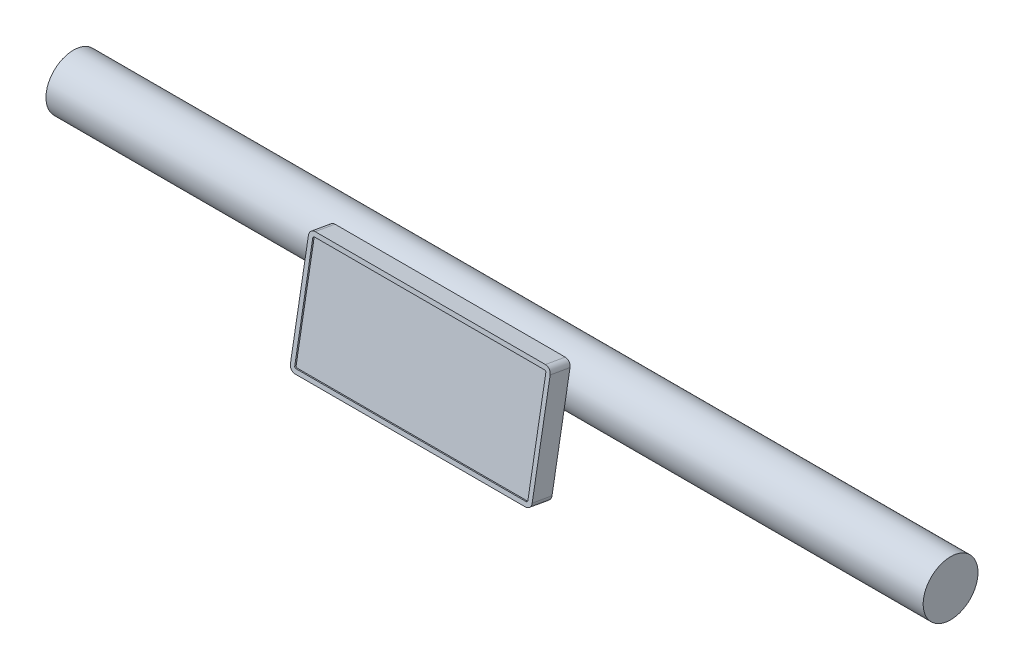
ISO-10303-21;
HEADER;
FILE_DESCRIPTION(('STEP AP214'),'2;1');
FILE_NAME('part.step','',(''),(''),'','','');
FILE_SCHEMA(('AUTOMOTIVE_DESIGN { 1 0 10303 214 1 1 1 1 }'));
ENDSEC;
DATA;
#1=APPLICATION_CONTEXT('core data for automotive mechanical design processes');
#2=APPLICATION_PROTOCOL_DEFINITION('international standard','automotive_design',2000,#1);
#3=PRODUCT_CONTEXT('',#1,'mechanical');
#4=PRODUCT('Part','Part','',(#3));
#5=PRODUCT_RELATED_PRODUCT_CATEGORY('part','',(#4));
#6=PRODUCT_DEFINITION_FORMATION('','',#4);
#7=PRODUCT_DEFINITION_CONTEXT('part definition',#1,'design');
#8=PRODUCT_DEFINITION('design','',#6,#7);
#9=PRODUCT_DEFINITION_SHAPE('','',#8);
#10=(LENGTH_UNIT() NAMED_UNIT(*) SI_UNIT(.MILLI.,.METRE.));
#11=(NAMED_UNIT(*) PLANE_ANGLE_UNIT() SI_UNIT($,.RADIAN.));
#12=(NAMED_UNIT(*) SI_UNIT($,.STERADIAN.) SOLID_ANGLE_UNIT());
#13=UNCERTAINTY_MEASURE_WITH_UNIT(LENGTH_MEASURE(1.E-05),#10,'distance_accuracy_value','');
#14=(GEOMETRIC_REPRESENTATION_CONTEXT(3) GLOBAL_UNCERTAINTY_ASSIGNED_CONTEXT((#13)) GLOBAL_UNIT_ASSIGNED_CONTEXT((#10,
#11,#12)) REPRESENTATION_CONTEXT('',''));
#15=CARTESIAN_POINT('',(0.,0.,0.));
#16=DIRECTION('',(0.,0.,1.));
#17=DIRECTION('',(1.,0.,0.));
#18=AXIS2_PLACEMENT_3D('',#15,#16,#17);
#19=CARTESIAN_POINT('',(0.,8.802727013857,49.9227456767448));
#20=DIRECTION('',(0.,0.173648177666931,0.984807753012208));
#21=DIRECTION('',(0.,-0.984807753012208,0.173648177666931));
#22=AXIS2_PLACEMENT_3D('',#19,#20,#21);
#23=PLANE('',#22);
#24=CARTESIAN_POINT('',(0.,8.802727013857,49.9227456767448));
#25=DIRECTION('',(0.,0.173648177666931,0.984807753012208));
#26=DIRECTION('',(0.,-0.984807753012208,0.173648177666931));
#27=AXIS2_PLACEMENT_3D('',#24,#25,#26);
#28=CIRCLE('',#27,8.26951653831873);
#29=CARTESIAN_POINT('',(0.,0.658843013258035,51.3587321538104));
#30=VERTEX_POINT('',#29);
#31=EDGE_CURVE('E67',#30,#30,#28,.T.);
#32=ORIENTED_EDGE('',*,*,#31,.T.);
#33=EDGE_LOOP('',(#32));
#34=FACE_BOUND('',#33,.T.);
#35=ADVANCED_FACE('F55',(#34),#23,.T.);
#36=CARTESIAN_POINT('',(0.,-4.18033182314457,-23.7078398685691));
#37=DIRECTION('',(0.,0.173648177666931,0.984807753012208));
#38=DIRECTION('',(0.,-0.984807753012208,0.173648177666931));
#39=AXIS2_PLACEMENT_3D('',#36,#37,#38);
#40=CYLINDRICAL_SURFACE('',#39,8.26951653831873);
#41=ORIENTED_EDGE('',*,*,#31,.F.);
#42=EDGE_LOOP('',(#41));
#43=FACE_BOUND('',#42,.T.);
#44=CARTESIAN_POINT('',(0.,-5.16381819926072,18.3367794774596));
#45=CARTESIAN_POINT('',(0.219655189088394,-5.16381620151997,18.3367810072159));
#46=CARTESIAN_POINT('',(0.439377320265203,-5.15445218994636,18.3394250431891));
#47=CARTESIAN_POINT('',(0.877206124997379,-5.11711204636189,18.349878141058));
#48=CARTESIAN_POINT('',(1.0953117177098,-5.08912442970438,18.3576903900263));
#49=CARTESIAN_POINT('',(1.52861103917354,-5.01483376242632,18.3781235909721));
#50=CARTESIAN_POINT('',(1.74379794821304,-4.96849359966656,18.3907542847957));
#51=CARTESIAN_POINT('',(2.1693553898151,-4.85807181949629,18.4202306527568));
#52=CARTESIAN_POINT('',(2.37972384250744,-4.79398269143535,18.4370781109689));
#53=CARTESIAN_POINT('',(2.79320907436325,-4.64916156075512,18.4741265133544));
#54=CARTESIAN_POINT('',(2.99635569306548,-4.56851051984341,18.4943110542451));
#55=CARTESIAN_POINT('',(3.39530234032595,-4.39121124897656,18.5372077617755));
#56=CARTESIAN_POINT('',(3.59109952406292,-4.29455690121431,18.559920893963));
#57=CARTESIAN_POINT('',(4.16558220269779,-3.98204064357322,18.6303920741817));
#58=CARTESIAN_POINT('',(4.53185461897858,-3.74344964140626,18.6805303026413));
#59=CARTESIAN_POINT('',(5.24497906273722,-3.19660833463106,18.7820620957828));
#60=CARTESIAN_POINT('',(5.58925749145999,-2.88498020521202,18.8333436920081));
#61=CARTESIAN_POINT('',(6.06574549283916,-2.37915173975581,18.9016204565863));
#62=CARTESIAN_POINT('',(6.21801289866175,-2.20400781880632,18.9229503928001));
#63=CARTESIAN_POINT('',(6.50837045063005,-1.84195994240168,18.9616130191569));
#64=CARTESIAN_POINT('',(6.64646581892849,-1.6550603599488,18.9789471846283));
#65=CARTESIAN_POINT('',(6.91391112904946,-1.26134229356765,19.0092704992803));
#66=CARTESIAN_POINT('',(7.04251542177446,-1.05399765185977,19.0220090501553));
#67=CARTESIAN_POINT('',(7.2820858929146,-0.62916544243483,19.0407938158614));
#68=CARTESIAN_POINT('',(7.39305936723974,-0.41168211870728,19.0468428051478));
#69=CARTESIAN_POINT('',(7.59639024251035,0.031870927593084,19.0512640179856));
#70=CARTESIAN_POINT('',(7.68875034909277,0.257939396544343,19.049637358109));
#71=CARTESIAN_POINT('',(7.85390595137308,0.716900581027549,19.0378893011702));
#72=CARTESIAN_POINT('',(7.92670294901037,0.949792771151303,19.0277685564797));
#73=CARTESIAN_POINT('',(8.0483948285927,1.40727812909326,18.999253277779));
#74=CARTESIAN_POINT('',(8.09839838881553,1.63160743825881,18.9813528899846));
#75=CARTESIAN_POINT('',(8.1796646050306,2.08282320408284,18.9371518933546));
#76=CARTESIAN_POINT('',(8.21092790061269,2.30970957320166,18.9108515712488));
#77=CARTESIAN_POINT('',(8.25433593686597,2.76408749625969,18.8497970370862));
#78=CARTESIAN_POINT('',(8.26648785747635,2.99157879074444,18.8150460055386));
#79=CARTESIAN_POINT('',(8.27154654325693,3.4453521266954,18.73726311607));
#80=CARTESIAN_POINT('',(8.26445413183389,3.67163421948461,18.6942316125186));
#81=CARTESIAN_POINT('',(8.23222088466368,4.10622855803215,18.6034235315635));
#82=CARTESIAN_POINT('',(8.20830661590132,4.31473831077778,18.5561500346328));
#83=CARTESIAN_POINT('',(8.1440183854232,4.72772030680401,18.4552528319562));
#84=CARTESIAN_POINT('',(8.10363873425165,4.93219112883995,18.4016269357483));
#85=CARTESIAN_POINT('',(8.00683927674423,5.33561651185817,18.288727740533));
#86=CARTESIAN_POINT('',(7.95042493341361,5.53457292630013,18.229456369499));
#87=CARTESIAN_POINT('',(7.82205432252265,5.9259248827998,18.1060220225364));
#88=CARTESIAN_POINT('',(7.7500921336416,6.11831789280371,18.0418571889972));
#89=CARTESIAN_POINT('',(7.59007361454988,6.49822778853301,17.9085640049179));
#90=CARTESIAN_POINT('',(7.5017935720117,6.68562939356093,17.8393759681607));
#91=CARTESIAN_POINT('',(7.31055181769443,7.05163642653049,17.6978935920865));
#92=CARTESIAN_POINT('',(7.20758512917372,7.23023884505037,17.6255982056333));
#93=CARTESIAN_POINT('',(6.98771936349512,7.57779855925861,17.4789887915528));
#94=CARTESIAN_POINT('',(6.87081881378961,7.74675483273498,17.4046745512124));
#95=CARTESIAN_POINT('',(6.62383700033592,8.07432473566308,17.2551500486373));
#96=CARTESIAN_POINT('',(6.49375492345079,8.23293772606923,17.1799397313786));
#97=CARTESIAN_POINT('',(6.21081833849405,8.55083166435873,17.0240841807172));
#98=CARTESIAN_POINT('',(6.05698515220065,8.70925242505503,16.9434589807021));
#99=CARTESIAN_POINT('',(5.73589016715686,9.01271780201716,16.7840041801993));
#100=CARTESIAN_POINT('',(5.56863210989635,9.15776612111395,16.7051740872263));
#101=CARTESIAN_POINT('',(5.221424591404,9.43403560188141,16.5507262738723));
#102=CARTESIAN_POINT('',(5.04146508489779,9.56524560990465,16.4751111736246));
#103=CARTESIAN_POINT('',(4.66999823583057,9.81305277028846,16.3287232346911));
#104=CARTESIAN_POINT('',(4.47849533304577,9.92965548839816,16.2579485563772));
#105=CARTESIAN_POINT('',(4.07725220182073,10.1519344956019,16.120126880594));
#106=CARTESIAN_POINT('',(3.86709267344189,10.2570113728108,16.0533310309602));
#107=CARTESIAN_POINT('',(3.43671450534751,10.4500691433459,15.9283327234478));
#108=CARTESIAN_POINT('',(3.21650035026974,10.5380575683416,15.8701264824612));
#109=CARTESIAN_POINT('',(2.76748840573833,10.6962782861926,15.7639213269818));
#110=CARTESIAN_POINT('',(2.5386941306581,10.7665177596453,15.7159182858881));
#111=CARTESIAN_POINT('',(2.07416282288511,10.88863657127,15.6315583415802));
#112=CARTESIAN_POINT('',(1.83842647581516,10.9405177160298,15.5952002924509));
#113=CARTESIAN_POINT('',(1.37832858353715,11.0224692426172,15.5373745607957));
#114=CARTESIAN_POINT('',(1.1542965293065,11.0537919980023,15.5150562925459));
#115=CARTESIAN_POINT('',(0.703666982364702,11.0997326331803,15.4822233690735));
#116=CARTESIAN_POINT('',(0.477069609528967,11.1143512903158,15.4717081645834));
#117=CARTESIAN_POINT('',(0.0232557456098629,11.1267270546186,15.4628103229334));
#118=CARTESIAN_POINT('',(-0.203960505411435,11.1244899663159,15.4644235091789));
#119=CARTESIAN_POINT('',(-0.657188075181639,11.1031918666497,15.4797223078762));
#120=CARTESIAN_POINT('',(-0.883199436513483,11.0841314538712,15.4934074907984));
#121=CARTESIAN_POINT('',(-1.31590264005513,11.0313743004465,15.5310089177762));
#122=CARTESIAN_POINT('',(-1.52280839927234,10.9988372942582,15.5541125903008));
#123=CARTESIAN_POINT('',(-1.93269712359148,10.9197286673815,15.6097521603309));
#124=CARTESIAN_POINT('',(-2.1356787212761,10.8731522450711,15.642291284711));
#125=CARTESIAN_POINT('',(-2.5363665613543,10.7663327724747,15.7160040799502));
#126=CARTESIAN_POINT('',(-2.7340738138688,10.7060923603668,15.7571760838981));
#127=CARTESIAN_POINT('',(-3.12318186832205,10.5723525806163,15.8472188776646));
#128=CARTESIAN_POINT('',(-3.31458016211612,10.4988480131973,15.8960926857671));
#129=CARTESIAN_POINT('',(-3.89411531939922,10.2521195510539,16.0572828201591));
#130=CARTESIAN_POINT('',(-4.27020256925192,10.0572841574041,16.1808613514844));
#131=CARTESIAN_POINT('',(-4.98308242676739,9.61564131813472,16.4471328098606));
#132=CARTESIAN_POINT('',(-5.31985695230412,9.36881010196558,16.5898344683976));
#133=CARTESIAN_POINT('',(-5.80482438016334,8.95062396370954,16.8171678001365));
#134=CARTESIAN_POINT('',(-5.96915440289585,8.7959601822193,16.8987109333524));
#135=CARTESIAN_POINT('',(-6.28329051276508,8.47309401346254,17.0628815972656));
#136=CARTESIAN_POINT('',(-6.43310138276642,8.3048961182178,17.1455087606109));
#137=CARTESIAN_POINT('',(-6.71731571956639,7.95559631456639,17.3103526547372));
#138=CARTESIAN_POINT('',(-6.85171073401001,7.77448741458993,17.3925691369422));
#139=CARTESIAN_POINT('',(-7.10396622397094,7.40037337680125,17.5550144702211));
#140=CARTESIAN_POINT('',(-7.22183386095243,7.20737344398979,17.6352441697001));
#141=CARTESIAN_POINT('',(-7.44081636969456,6.80914237893688,17.7928137217949));
#142=CARTESIAN_POINT('',(-7.54181887713926,6.60384070199626,17.8701317247966));
#143=CARTESIAN_POINT('',(-7.72517783884507,6.18336537440777,18.0199415651736));
#144=CARTESIAN_POINT('',(-7.80753401384833,5.96819157596756,18.0924333302569));
#145=CARTESIAN_POINT('',(-7.95267402458318,5.52955265023494,18.2312762523699));
#146=CARTESIAN_POINT('',(-8.01546832208403,5.30609202657603,18.2976306782759));
#147=CARTESIAN_POINT('',(-8.12079859221801,4.85247199311595,18.4231206356784));
#148=CARTESIAN_POINT('',(-8.16333624918694,4.62231314196038,18.4822567670704));
#149=CARTESIAN_POINT('',(-8.22521731385455,4.17460173091883,18.5882787741812));
#150=CARTESIAN_POINT('',(-8.24605724606268,3.95739344282192,18.6357500179855));
#151=CARTESIAN_POINT('',(-8.2697086412662,3.5205050243494,18.7231985019581));
#152=CARTESIAN_POINT('',(-8.27252105188549,3.30082502450843,18.7631761359238));
#153=CARTESIAN_POINT('',(-8.26008723488128,2.86073550777799,18.8352968624309));
#154=CARTESIAN_POINT('',(-8.24484426759246,2.64032612976131,18.8674413681693));
#155=CARTESIAN_POINT('',(-8.19647890896205,2.20045953653846,18.9237850492549));
#156=CARTESIAN_POINT('',(-8.16335668642668,1.9810023123623,18.9479842996134));
#157=CARTESIAN_POINT('',(-8.0813269459123,1.55372257024157,18.9876954796592));
#158=CARTESIAN_POINT('',(-8.03312583930689,1.34579316014542,19.0035241902463));
#159=CARTESIAN_POINT('',(-7.92106815093662,0.93370281306111,19.0282243642802));
#160=CARTESIAN_POINT('',(-7.85720611030217,0.729543216841518,19.0370933972829));
#161=CARTESIAN_POINT('',(-7.71442149812644,0.326442152804938,19.0482698661814));
#162=CARTESIAN_POINT('',(-7.63550262317608,0.127499417808362,19.050578910408));
#163=CARTESIAN_POINT('',(-7.46320388344311,-0.264078842748771,19.0491762865956));
#164=CARTESIAN_POINT('',(-7.36981850519538,-0.456711929528671,19.0454623179382));
#165=CARTESIAN_POINT('',(-7.1647376629424,-0.843062129025682,19.0323614238195));
#166=CARTESIAN_POINT('',(-7.05240363331922,-1.0364317926933,19.0227247260501));
#167=CARTESIAN_POINT('',(-6.81346375422046,-1.41388950075699,18.998400001779));
#168=CARTESIAN_POINT('',(-6.68685299659286,-1.59797432147451,18.9837102345174));
#169=CARTESIAN_POINT('',(-6.4201688869699,-1.95576396567607,18.9501920721037));
#170=CARTESIAN_POINT('',(-6.28009324889401,-2.12946701838569,18.9313629734711));
#171=CARTESIAN_POINT('',(-5.98728897401294,-2.46546854394741,18.8905429433324));
#172=CARTESIAN_POINT('',(-5.83455968471633,-2.62776642788814,18.8685518487336));
#173=CARTESIAN_POINT('',(-5.50532485728796,-2.95171865646631,18.8206971006896));
#174=CARTESIAN_POINT('',(-5.32789516758328,-3.11241078883196,18.7946666818269));
#175=CARTESIAN_POINT('',(-4.96038793338964,-3.41827664512215,18.7414508803248));
#176=CARTESIAN_POINT('',(-4.77031446140817,-3.56345532696869,18.7142658705844));
#177=CARTESIAN_POINT('',(-4.37830886221901,-3.83732725020417,18.6600356918252));
#178=CARTESIAN_POINT('',(-4.17636457255692,-3.96600313839676,18.6329906982447));
#179=CARTESIAN_POINT('',(-3.76204726209226,-4.20544982880733,18.5804122152915));
#180=CARTESIAN_POINT('',(-3.54967902209531,-4.31622874101836,18.5548780446345));
#181=CARTESIAN_POINT('',(-3.11560529709178,-4.51884037505898,18.5065783990926));
#182=CARTESIAN_POINT('',(-2.89389404899763,-4.61066119064933,18.4838146677863));
#183=CARTESIAN_POINT('',(-2.44288940569287,-4.77410612212335,18.4422756004159));
#184=CARTESIAN_POINT('',(-2.21359984232219,-4.84574027562745,18.423498283296));
#185=CARTESIAN_POINT('',(-1.74972766548918,-4.96771764649391,18.3909831554433));
#186=CARTESIAN_POINT('',(-1.51516071662451,-5.01811687118653,18.3772321007627));
#187=CARTESIAN_POINT('',(-1.04224085937486,-5.09710052600429,18.3554832496391));
#188=CARTESIAN_POINT('',(-0.80389097387873,-5.12570155911805,18.3474810747243));
#189=CARTESIAN_POINT('',(-0.470802299244393,-5.15006261231111,18.3406484901445));
#190=CARTESIAN_POINT('',(-0.376727211257529,-5.15521890030377,18.3391992714765));
#191=CARTESIAN_POINT('',(-0.188438856768033,-5.16209715608874,18.3372644275336));
#192=CARTESIAN_POINT('',(-0.0942255875801685,-5.16381905623249,18.3367788212393));
#193=CARTESIAN_POINT('',(0.,-5.16381819926072,18.3367794774596));
#194=B_SPLINE_CURVE_WITH_KNOTS('',3,(#44,#45,#46,#47,#48,#49,#50,#51,#52,#53,#54,#55,#56,#57,
#58,#59,#60,#61,#62,#63,#64,#65,#66,#67,#68,#69,#70,#71,#72,#73,#74,#75,#76,#77,#78,#79,#80,#81,
#82,#83,#84,#85,#86,#87,#88,#89,#90,#91,#92,#93,#94,#95,#96,#97,#98,#99,#100,#101,#102,#103,
#104,#105,#106,#107,#108,#109,#110,#111,#112,#113,#114,#115,#116,#117,#118,#119,#120,#121,#122,
#123,#124,#125,#126,#127,#128,#129,#130,#131,#132,#133,#134,#135,#136,#137,#138,#139,#140,#141,
#142,#143,#144,#145,#146,#147,#148,#149,#150,#151,#152,#153,#154,#155,#156,#157,#158,#159,#160,
#161,#162,#163,#164,#165,#166,#167,#168,#169,#170,#171,#172,#173,#174,#175,#176,#177,#178,#179,
#180,#181,#182,#183,#184,#185,#186,#187,#188,#189,#190,#191,#192,#193),.UNSPECIFIED.,.T.,.F.,(4,
2,2,2,2,2,2,2,2,2,2,2,2,2,2,2,2,2,2,2,2,2,2,2,2,2,2,2,2,2,2,2,2,2,2,2,2,2,2,2,2,2,2,2,2,2,2,2,2,
2,2,2,2,2,2,2,2,2,2,2,2,2,2,2,2,2,2,2,2,2,2,2,2,2,4),(0.,0.658867753860532,1.31814218969661,
1.97875666015615,2.63965110443694,3.29738860152945,3.95537812411794,5.26979057590518,
6.664915188042,7.36346079938227,8.06174807738019,8.79379688416986,9.52554196413682,
10.257180600883,10.9887630506992,11.6794487979183,12.3701109712573,13.0605136081668,
13.750886705301,14.3955324074309,15.0404010497474,15.6850502487101,16.3299453932911,
16.9844442030735,17.6391653266634,18.293955703438,18.9487864972858,19.6532390437827,
20.3574959376912,21.0623161915592,21.7668670688358,22.4987519820456,23.2303135840831,
23.9615787466363,24.6927719275676,25.3737900361687,26.0547764515946,26.7355283698021,
27.4162560673781,28.0476930453288,28.6793462265946,29.3108775549226,29.9426569943254,
31.2604719165605,32.5788906071541,33.2980248712401,34.0169214288397,34.736210284742,
35.4551864966245,36.1787767048208,36.9023777491898,37.6255911418643,38.3487443889778,
39.017823192658,39.6868668256544,40.3557896650742,41.0247061889983,41.6660693418803,
42.307656370725,42.9490860862914,43.5907608673469,44.2615526695868,44.9325757884196,
45.6037130361136,46.2748849128779,46.9964221027957,47.717728003609,48.43978626727,
49.1615164077291,49.8836984462692,50.6055207506561,51.3254271399414,52.0447846499437,
52.3274138866113,52.6100486902906),.UNSPECIFIED.);
#195=CARTESIAN_POINT('',(0.,-5.16381819926072,18.3367794774596));
#196=VERTEX_POINT('',#195);
#197=EDGE_CURVE('E11',#196,#196,#194,.T.);
#198=ORIENTED_EDGE('',*,*,#197,.T.);
#199=EDGE_LOOP('',(#198));
#200=FACE_BOUND('',#199,.T.);
#201=ADVANCED_FACE('F57',(#43,#200),#40,.T.);
#202=CARTESIAN_POINT('',(304.8,0.,0.));
#203=DIRECTION('',(-1.,0.,0.));
#204=DIRECTION('',(0.,0.,1.));
#205=AXIS2_PLACEMENT_3D('',#202,#203,#204);
#206=CYLINDRICAL_SURFACE('',#205,19.05);
#207=ORIENTED_EDGE('',*,*,#197,.F.);
#208=EDGE_LOOP('',(#207));
#209=FACE_BOUND('',#208,.T.);
#210=ADVANCED_FACE('F75',(#209),#206,.F.);
#211=CLOSED_SHELL('',(#35,#201,#210));
#212=MANIFOLD_SOLID_BREP('B2',#211);
#213=CARTESIAN_POINT('',(84.,48.1950371343453,42.9768185700675));
#214=DIRECTION('',(1.,0.,0.));
#215=DIRECTION('',(0.,0.,-1.));
#216=AXIS2_PLACEMENT_3D('',#213,#214,#215);
#217=PLANE('',#216);
#218=DIRECTION('',(0.,0.984807753012208,-0.173648177666931));
#219=VECTOR('',#218,1.);
#220=CARTESIAN_POINT('',(84.,50.6261116216823,56.7641271122384));
#221=LINE('',#220,#219);
#222=CARTESIAN_POINT('',(84.,-24.2192776072455,69.9613886149252));
#223=VERTEX_POINT('',#222);
#224=CARTESIAN_POINT('',(84.,46.6868806096335,57.4587198229062));
#225=VERTEX_POINT('',#224);
#226=EDGE_CURVE('E287',#223,#225,#221,.T.);
#227=ORIENTED_EDGE('',*,*,#226,.F.);
#228=DIRECTION('',(0.,0.173648177666931,0.984807753012208));
#229=VECTOR('',#228,1.);
#230=CARTESIAN_POINT('',(84.,-26.6503520945825,56.1740800727543));
#231=LINE('',#230,#229);
#232=CARTESIAN_POINT('',(84.,-26.6503520945825,56.1740800727543));
#233=VERTEX_POINT('',#232);
#234=EDGE_CURVE('E337',#223,#233,#231,.F.);
#235=ORIENTED_EDGE('',*,*,#234,.T.);
#236=DIRECTION('',(0.,0.984807753012208,-0.173648177666931));
#237=VECTOR('',#236,1.);
#238=CARTESIAN_POINT('',(84.,48.1950371343453,42.9768185700675));
#239=LINE('',#238,#237);
#240=CARTESIAN_POINT('',(84.,44.2558061222965,43.6714112807352));
#241=VERTEX_POINT('',#240);
#242=EDGE_CURVE('E299',#233,#241,#239,.T.);
#243=ORIENTED_EDGE('',*,*,#242,.T.);
#244=DIRECTION('',(0.,0.173648177666931,0.984807753012208));
#245=VECTOR('',#244,1.);
#246=CARTESIAN_POINT('',(84.,44.2558061222965,43.6714112807352));
#247=LINE('',#246,#245);
#248=EDGE_CURVE('E334',#241,#225,#247,.T.);
#249=ORIENTED_EDGE('',*,*,#248,.T.);
#250=EDGE_LOOP('',(#227,#235,#243,#249));
#251=FACE_BOUND('',#250,.T.);
#252=ADVANCED_FACE('F114',(#251),#217,.T.);
#253=CARTESIAN_POINT('',(84.,-30.5895831066313,56.868672783422));
#254=DIRECTION('',(0.,-0.984807753012208,0.173648177666931));
#255=DIRECTION('',(0.,-0.173648177666931,-0.984807753012208));
#256=AXIS2_PLACEMENT_3D('',#253,#254,#255);
#257=PLANE('',#256);
#258=DIRECTION('',(1.,0.,0.));
#259=VECTOR('',#258,1.);
#260=CARTESIAN_POINT('',(84.,-30.5895831066313,56.868672783422));
#261=LINE('',#260,#259);
#262=CARTESIAN_POINT('',(-80.,-30.5895831066313,56.868672783422));
#263=VERTEX_POINT('',#262);
#264=CARTESIAN_POINT('',(80.,-30.5895831066313,56.868672783422));
#265=VERTEX_POINT('',#264);
#266=EDGE_CURVE('E308',#263,#265,#261,.T.);
#267=ORIENTED_EDGE('',*,*,#266,.T.);
#268=DIRECTION('',(0.,0.173648177666931,0.984807753012208));
#269=VECTOR('',#268,1.);
#270=CARTESIAN_POINT('',(80.,-30.5895831066313,56.868672783422));
#271=LINE('',#270,#269);
#272=CARTESIAN_POINT('',(80.,-28.1585086192943,70.6559813255929));
#273=VERTEX_POINT('',#272);
#274=EDGE_CURVE('E323',#265,#273,#271,.T.);
#275=ORIENTED_EDGE('',*,*,#274,.T.);
#276=DIRECTION('',(1.,0.,0.));
#277=VECTOR('',#276,1.);
#278=CARTESIAN_POINT('',(84.,-28.1585086192943,70.6559813255929));
#279=LINE('',#278,#277);
#280=CARTESIAN_POINT('',(-80.,-28.1585086192943,70.6559813255929));
#281=VERTEX_POINT('',#280);
#282=EDGE_CURVE('E303',#281,#273,#279,.T.);
#283=ORIENTED_EDGE('',*,*,#282,.F.);
#284=DIRECTION('',(0.,0.173648177666931,0.984807753012208));
#285=VECTOR('',#284,1.);
#286=CARTESIAN_POINT('',(-80.,-30.5895831066313,56.868672783422));
#287=LINE('',#286,#285);
#288=EDGE_CURVE('E311',#281,#263,#287,.F.);
#289=ORIENTED_EDGE('',*,*,#288,.T.);
#290=EDGE_LOOP('',(#267,#275,#283,#289));
#291=FACE_BOUND('',#290,.T.);
#292=ADVANCED_FACE('F382',(#291),#257,.T.);
#293=CARTESIAN_POINT('',(-84.,48.1950371343453,42.9768185700675));
#294=DIRECTION('',(-1.,0.,0.));
#295=DIRECTION('',(0.,-1.,0.));
#296=AXIS2_PLACEMENT_3D('',#293,#294,#295);
#297=PLANE('',#296);
#298=DIRECTION('',(0.,-0.984807753012208,0.173648177666931));
#299=VECTOR('',#298,1.);
#300=CARTESIAN_POINT('',(-84.,50.6261116216823,56.7641271122384));
#301=LINE('',#300,#299);
#302=CARTESIAN_POINT('',(-84.,46.6868806096335,57.4587198229062));
#303=VERTEX_POINT('',#302);
#304=CARTESIAN_POINT('',(-84.,-24.2192776072455,69.9613886149252));
#305=VERTEX_POINT('',#304);
#306=EDGE_CURVE('E317',#303,#305,#301,.T.);
#307=ORIENTED_EDGE('',*,*,#306,.F.);
#308=DIRECTION('',(0.,0.173648177666931,0.984807753012208));
#309=VECTOR('',#308,1.);
#310=CARTESIAN_POINT('',(-84.,44.2558061222965,43.6714112807352));
#311=LINE('',#310,#309);
#312=CARTESIAN_POINT('',(-84.,44.2558061222965,43.6714112807352));
#313=VERTEX_POINT('',#312);
#314=EDGE_CURVE('E53',#303,#313,#311,.F.);
#315=ORIENTED_EDGE('',*,*,#314,.T.);
#316=DIRECTION('',(0.,-0.984807753012208,0.173648177666931));
#317=VECTOR('',#316,1.);
#318=CARTESIAN_POINT('',(-84.,48.1950371343453,42.9768185700675));
#319=LINE('',#318,#317);
#320=CARTESIAN_POINT('',(-84.,-26.6503520945825,56.1740800727543));
#321=VERTEX_POINT('',#320);
#322=EDGE_CURVE('E305',#313,#321,#319,.T.);
#323=ORIENTED_EDGE('',*,*,#322,.T.);
#324=DIRECTION('',(0.,0.173648177666931,0.984807753012208));
#325=VECTOR('',#324,1.);
#326=CARTESIAN_POINT('',(-84.,-26.6503520945825,56.1740800727543));
#327=LINE('',#326,#325);
#328=EDGE_CURVE('E122',#321,#305,#327,.T.);
#329=ORIENTED_EDGE('',*,*,#328,.T.);
#330=EDGE_LOOP('',(#307,#315,#323,#329));
#331=FACE_BOUND('',#330,.T.);
#332=ADVANCED_FACE('F354',(#331),#297,.T.);
#333=CARTESIAN_POINT('',(84.,48.1950371343453,42.9768185700675));
#334=DIRECTION('',(0.,0.984807753012208,-0.173648177666931));
#335=DIRECTION('',(0.,0.173648177666931,0.984807753012208));
#336=AXIS2_PLACEMENT_3D('',#333,#334,#335);
#337=PLANE('',#336);
#338=DIRECTION('',(-1.,0.,0.));
#339=VECTOR('',#338,1.);
#340=CARTESIAN_POINT('',(84.,50.6261116216823,56.7641271122384));
#341=LINE('',#340,#339);
#342=CARTESIAN_POINT('',(80.,50.6261116216823,56.7641271122384));
#343=VERTEX_POINT('',#342);
#344=CARTESIAN_POINT('',(-80.,50.6261116216823,56.7641271122384));
#345=VERTEX_POINT('',#344);
#346=EDGE_CURVE('E314',#343,#345,#341,.T.);
#347=ORIENTED_EDGE('',*,*,#346,.F.);
#348=DIRECTION('',(0.,0.173648177666931,0.984807753012208));
#349=VECTOR('',#348,1.);
#350=CARTESIAN_POINT('',(80.,48.1950371343453,42.9768185700675));
#351=LINE('',#350,#349);
#352=CARTESIAN_POINT('',(80.,48.1950371343453,42.9768185700675));
#353=VERTEX_POINT('',#352);
#354=EDGE_CURVE('E349',#343,#353,#351,.F.);
#355=ORIENTED_EDGE('',*,*,#354,.T.);
#356=DIRECTION('',(-1.,0.,0.));
#357=VECTOR('',#356,1.);
#358=CARTESIAN_POINT('',(84.,48.1950371343453,42.9768185700675));
#359=LINE('',#358,#357);
#360=CARTESIAN_POINT('',(-80.,48.1950371343453,42.9768185700675));
#361=VERTEX_POINT('',#360);
#362=EDGE_CURVE('E302',#353,#361,#359,.T.);
#363=ORIENTED_EDGE('',*,*,#362,.T.);
#364=DIRECTION('',(0.,0.173648177666931,0.984807753012208));
#365=VECTOR('',#364,1.);
#366=CARTESIAN_POINT('',(-80.,48.1950371343453,42.9768185700675));
#367=LINE('',#366,#365);
#368=EDGE_CURVE('E346',#361,#345,#367,.T.);
#369=ORIENTED_EDGE('',*,*,#368,.T.);
#370=EDGE_LOOP('',(#347,#355,#363,#369));
#371=FACE_BOUND('',#370,.T.);
#372=ADVANCED_FACE('F366',(#371),#337,.T.);
#373=CARTESIAN_POINT('',(0.,8.80272701385699,49.9227456767448));
#374=DIRECTION('',(0.,-0.173648177666931,-0.984807753012208));
#375=DIRECTION('',(0.,0.984807753012208,-0.173648177666931));
#376=AXIS2_PLACEMENT_3D('',#373,#374,#375);
#377=PLANE('',#376);
#378=ORIENTED_EDGE('',*,*,#242,.F.);
#379=CARTESIAN_POINT('',(80.,-26.6503520945825,56.1740800727543));
#380=DIRECTION('',(0.,-0.173648177666931,-0.984807753012208));
#381=DIRECTION('',(0.,0.984807753012208,-0.173648177666931));
#382=AXIS2_PLACEMENT_3D('',#379,#380,#381);
#383=CIRCLE('',#382,4.);
#384=EDGE_CURVE('E344',#233,#265,#383,.T.);
#385=ORIENTED_EDGE('',*,*,#384,.T.);
#386=ORIENTED_EDGE('',*,*,#266,.F.);
#387=CARTESIAN_POINT('',(-80.,-26.6503520945825,56.1740800727543));
#388=DIRECTION('',(0.,-0.173648177666931,-0.984807753012208));
#389=DIRECTION('',(0.,0.984807753012208,-0.173648177666931));
#390=AXIS2_PLACEMENT_3D('',#387,#388,#389);
#391=CIRCLE('',#390,4.);
#392=EDGE_CURVE('E339',#263,#321,#391,.T.);
#393=ORIENTED_EDGE('',*,*,#392,.T.);
#394=ORIENTED_EDGE('',*,*,#322,.F.);
#395=CARTESIAN_POINT('',(-80.,44.2558061222965,43.6714112807352));
#396=DIRECTION('',(0.,-0.173648177666931,-0.984807753012208));
#397=DIRECTION('',(0.,0.984807753012208,-0.173648177666931));
#398=AXIS2_PLACEMENT_3D('',#395,#396,#397);
#399=CIRCLE('',#398,4.);
#400=EDGE_CURVE('E137',#313,#361,#399,.T.);
#401=ORIENTED_EDGE('',*,*,#400,.T.);
#402=ORIENTED_EDGE('',*,*,#362,.F.);
#403=CARTESIAN_POINT('',(80.,44.2558061222965,43.6714112807352));
#404=DIRECTION('',(0.,-0.173648177666931,-0.984807753012208));
#405=DIRECTION('',(0.,0.984807753012208,-0.173648177666931));
#406=AXIS2_PLACEMENT_3D('',#403,#404,#405);
#407=CIRCLE('',#406,4.);
#408=EDGE_CURVE('E342',#353,#241,#407,.T.);
#409=ORIENTED_EDGE('',*,*,#408,.T.);
#410=EDGE_LOOP('',(#378,#385,#386,#393,#394,#401,#402,#409));
#411=FACE_BOUND('',#410,.T.);
#412=ADVANCED_FACE('F370',(#411),#377,.T.);
#413=CARTESIAN_POINT('',(0.,11.233801501194,63.7100542189157));
#414=DIRECTION('',(0.,-0.173648177666931,-0.984807753012208));
#415=DIRECTION('',(0.,0.984807753012208,-0.173648177666931));
#416=AXIS2_PLACEMENT_3D('',#413,#414,#415);
#417=PLANE('',#416);
#418=DIRECTION('',(1.,0.,0.));
#419=VECTOR('',#418,1.);
#420=CARTESIAN_POINT('',(-80.,-25.2040853602577,70.1350367925921));
#421=LINE('',#420,#419);
#422=CARTESIAN_POINT('',(-80.,-25.2040853602577,70.1350367925921));
#423=VERTEX_POINT('',#422);
#424=CARTESIAN_POINT('',(80.,-25.2040853602577,70.1350367925921));
#425=VERTEX_POINT('',#424);
#426=EDGE_CURVE('E269',#423,#425,#421,.T.);
#427=ORIENTED_EDGE('',*,*,#426,.F.);
#428=CARTESIAN_POINT('',(-80.,-24.2192776072455,69.9613886149252));
#429=DIRECTION('',(0.,0.173648177666931,0.984807753012208));
#430=DIRECTION('',(0.,-0.984807753012208,0.173648177666931));
#431=AXIS2_PLACEMENT_3D('',#428,#429,#430);
#432=CIRCLE('',#431,0.999999999999995);
#433=CARTESIAN_POINT('',(-81.,-24.2192776072455,69.9613886149252));
#434=VERTEX_POINT('',#433);
#435=EDGE_CURVE('E129',#434,#423,#432,.T.);
#436=ORIENTED_EDGE('',*,*,#435,.F.);
#437=DIRECTION('',(0.,-0.984807753012208,0.173648177666931));
#438=VECTOR('',#437,1.);
#439=CARTESIAN_POINT('',(-81.,46.6868806096335,57.4587198229062));
#440=LINE('',#439,#438);
#441=CARTESIAN_POINT('',(-81.,46.6868806096335,57.4587198229062));
#442=VERTEX_POINT('',#441);
#443=EDGE_CURVE('E249',#442,#434,#440,.T.);
#444=ORIENTED_EDGE('',*,*,#443,.F.);
#445=CARTESIAN_POINT('',(-80.,46.6868806096335,57.4587198229062));
#446=DIRECTION('',(0.,0.173648177666931,0.984807753012208));
#447=DIRECTION('',(0.,-0.984807753012208,0.173648177666931));
#448=AXIS2_PLACEMENT_3D('',#445,#446,#447);
#449=CIRCLE('',#448,0.999999999999975);
#450=CARTESIAN_POINT('',(-80.,47.6716883626457,57.2850716452392));
#451=VERTEX_POINT('',#450);
#452=EDGE_CURVE('E252',#451,#442,#449,.T.);
#453=ORIENTED_EDGE('',*,*,#452,.F.);
#454=DIRECTION('',(-1.,0.,0.));
#455=VECTOR('',#454,1.);
#456=CARTESIAN_POINT('',(80.,47.6716883626457,57.2850716452392));
#457=LINE('',#456,#455);
#458=CARTESIAN_POINT('',(80.,47.6716883626457,57.2850716452392));
#459=VERTEX_POINT('',#458);
#460=EDGE_CURVE('E280',#459,#451,#457,.T.);
#461=ORIENTED_EDGE('',*,*,#460,.F.);
#462=CARTESIAN_POINT('',(80.,46.6868806096335,57.4587198229062));
#463=DIRECTION('',(0.,0.173648177666931,0.984807753012208));
#464=DIRECTION('',(0.,-0.984807753012208,0.173648177666931));
#465=AXIS2_PLACEMENT_3D('',#462,#463,#464);
#466=CIRCLE('',#465,1.);
#467=CARTESIAN_POINT('',(81.,46.6868806096335,57.4587198229062));
#468=VERTEX_POINT('',#467);
#469=EDGE_CURVE('E277',#468,#459,#466,.T.);
#470=ORIENTED_EDGE('',*,*,#469,.F.);
#471=DIRECTION('',(0.,0.984807753012208,-0.173648177666931));
#472=VECTOR('',#471,1.);
#473=CARTESIAN_POINT('',(81.,-24.2192776072455,69.9613886149252));
#474=LINE('',#473,#472);
#475=CARTESIAN_POINT('',(81.,-24.2192776072455,69.9613886149252));
#476=VERTEX_POINT('',#475);
#477=EDGE_CURVE('E274',#476,#468,#474,.T.);
#478=ORIENTED_EDGE('',*,*,#477,.F.);
#479=CARTESIAN_POINT('',(80.,-24.2192776072455,69.9613886149252));
#480=DIRECTION('',(0.,0.173648177666931,0.984807753012208));
#481=DIRECTION('',(0.,-0.984807753012208,0.173648177666931));
#482=AXIS2_PLACEMENT_3D('',#479,#480,#481);
#483=CIRCLE('',#482,1.);
#484=EDGE_CURVE('E271',#425,#476,#483,.T.);
#485=ORIENTED_EDGE('',*,*,#484,.F.);
#486=EDGE_LOOP('',(#427,#436,#444,#453,#461,#470,#478,#485));
#487=FACE_BOUND('',#486,.T.);
#488=ORIENTED_EDGE('',*,*,#282,.T.);
#489=CARTESIAN_POINT('',(80.,-24.2192776072455,69.9613886149252));
#490=DIRECTION('',(0.,-0.173648177666931,-0.984807753012208));
#491=DIRECTION('',(0.,0.984807753012208,-0.173648177666931));
#492=AXIS2_PLACEMENT_3D('',#489,#490,#491);
#493=CIRCLE('',#492,4.);
#494=EDGE_CURVE('E332',#273,#223,#493,.F.);
#495=ORIENTED_EDGE('',*,*,#494,.T.);
#496=ORIENTED_EDGE('',*,*,#226,.T.);
#497=CARTESIAN_POINT('',(80.,46.6868806096335,57.4587198229062));
#498=DIRECTION('',(0.,-0.173648177666931,-0.984807753012208));
#499=DIRECTION('',(0.,0.984807753012208,-0.173648177666931));
#500=AXIS2_PLACEMENT_3D('',#497,#498,#499);
#501=CIRCLE('',#500,4.);
#502=EDGE_CURVE('E330',#225,#343,#501,.F.);
#503=ORIENTED_EDGE('',*,*,#502,.T.);
#504=ORIENTED_EDGE('',*,*,#346,.T.);
#505=CARTESIAN_POINT('',(-80.,46.6868806096335,57.4587198229062));
#506=DIRECTION('',(0.,-0.173648177666931,-0.984807753012208));
#507=DIRECTION('',(0.,0.984807753012208,-0.173648177666931));
#508=AXIS2_PLACEMENT_3D('',#505,#506,#507);
#509=CIRCLE('',#508,4.);
#510=EDGE_CURVE('E328',#345,#303,#509,.F.);
#511=ORIENTED_EDGE('',*,*,#510,.T.);
#512=ORIENTED_EDGE('',*,*,#306,.T.);
#513=CARTESIAN_POINT('',(-80.,-24.2192776072455,69.9613886149252));
#514=DIRECTION('',(0.,-0.173648177666931,-0.984807753012208));
#515=DIRECTION('',(0.,0.984807753012208,-0.173648177666931));
#516=AXIS2_PLACEMENT_3D('',#513,#514,#515);
#517=CIRCLE('',#516,4.);
#518=EDGE_CURVE('E326',#305,#281,#517,.F.);
#519=ORIENTED_EDGE('',*,*,#518,.T.);
#520=EDGE_LOOP('',(#488,#495,#496,#503,#504,#511,#512,#519));
#521=FACE_BOUND('',#520,.T.);
#522=ADVANCED_FACE('F359',(#487,#521),#417,.F.);
#523=CARTESIAN_POINT('',(80.,-26.6503520945825,56.1740800727543));
#524=DIRECTION('',(0.,0.173648177666931,0.984807753012208));
#525=DIRECTION('',(0.,-0.984807753012208,0.173648177666931));
#526=AXIS2_PLACEMENT_3D('',#523,#524,#525);
#527=CYLINDRICAL_SURFACE('',#526,4.);
#528=ORIENTED_EDGE('',*,*,#384,.F.);
#529=ORIENTED_EDGE('',*,*,#234,.F.);
#530=ORIENTED_EDGE('',*,*,#494,.F.);
#531=ORIENTED_EDGE('',*,*,#274,.F.);
#532=EDGE_LOOP('',(#528,#529,#530,#531));
#533=FACE_BOUND('',#532,.T.);
#534=ADVANCED_FACE('F380',(#533),#527,.T.);
#535=CARTESIAN_POINT('',(80.,44.2558061222965,43.6714112807352));
#536=DIRECTION('',(0.,0.173648177666931,0.984807753012208));
#537=DIRECTION('',(0.,-0.984807753012208,0.173648177666931));
#538=AXIS2_PLACEMENT_3D('',#535,#536,#537);
#539=CYLINDRICAL_SURFACE('',#538,4.);
#540=ORIENTED_EDGE('',*,*,#408,.F.);
#541=ORIENTED_EDGE('',*,*,#354,.F.);
#542=ORIENTED_EDGE('',*,*,#502,.F.);
#543=ORIENTED_EDGE('',*,*,#248,.F.);
#544=EDGE_LOOP('',(#540,#541,#542,#543));
#545=FACE_BOUND('',#544,.T.);
#546=ADVANCED_FACE('F373',(#545),#539,.T.);
#547=CARTESIAN_POINT('',(-80.,44.2558061222965,43.6714112807352));
#548=DIRECTION('',(0.,0.173648177666931,0.984807753012208));
#549=DIRECTION('',(0.,-0.984807753012208,0.173648177666931));
#550=AXIS2_PLACEMENT_3D('',#547,#548,#549);
#551=CYLINDRICAL_SURFACE('',#550,4.);
#552=ORIENTED_EDGE('',*,*,#400,.F.);
#553=ORIENTED_EDGE('',*,*,#314,.F.);
#554=ORIENTED_EDGE('',*,*,#510,.F.);
#555=ORIENTED_EDGE('',*,*,#368,.F.);
#556=EDGE_LOOP('',(#552,#553,#554,#555));
#557=FACE_BOUND('',#556,.T.);
#558=ADVANCED_FACE('F364',(#557),#551,.T.);
#559=CARTESIAN_POINT('',(-80.,-26.6503520945825,56.1740800727543));
#560=DIRECTION('',(0.,0.173648177666931,0.984807753012208));
#561=DIRECTION('',(0.,-0.984807753012208,0.173648177666931));
#562=AXIS2_PLACEMENT_3D('',#559,#560,#561);
#563=CYLINDRICAL_SURFACE('',#562,4.);
#564=ORIENTED_EDGE('',*,*,#392,.F.);
#565=ORIENTED_EDGE('',*,*,#288,.F.);
#566=ORIENTED_EDGE('',*,*,#518,.F.);
#567=ORIENTED_EDGE('',*,*,#328,.F.);
#568=EDGE_LOOP('',(#564,#565,#566,#567));
#569=FACE_BOUND('',#568,.T.);
#570=ADVANCED_FACE('F116',(#569),#563,.T.);
#571=CARTESIAN_POINT('',(-80.,-24.3929257849124,68.976580861913));
#572=DIRECTION('',(0.,0.173648177666931,0.984807753012208));
#573=DIRECTION('',(0.,-0.984807753012208,0.173648177666931));
#574=AXIS2_PLACEMENT_3D('',#571,#572,#573);
#575=CYLINDRICAL_SURFACE('',#574,0.999999999999995);
#576=ORIENTED_EDGE('',*,*,#435,.T.);
#577=DIRECTION('',(0.,0.173648177666931,0.984807753012208));
#578=VECTOR('',#577,1.);
#579=CARTESIAN_POINT('',(-80.,-25.3777335379246,69.1502290395799));
#580=LINE('',#579,#578);
#581=CARTESIAN_POINT('',(-80.,-25.3777335379246,69.1502290395799));
#582=VERTEX_POINT('',#581);
#583=EDGE_CURVE('E226',#582,#423,#580,.T.);
#584=ORIENTED_EDGE('',*,*,#583,.F.);
#585=CARTESIAN_POINT('',(-80.,-24.3929257849124,68.976580861913));
#586=DIRECTION('',(0.,0.173648177666931,0.984807753012208));
#587=DIRECTION('',(0.,-0.984807753012208,0.173648177666931));
#588=AXIS2_PLACEMENT_3D('',#585,#586,#587);
#589=CIRCLE('',#588,0.999999999999995);
#590=CARTESIAN_POINT('',(-81.,-24.3929257849124,68.976580861913));
#591=VERTEX_POINT('',#590);
#592=EDGE_CURVE('E230',#591,#582,#589,.T.);
#593=ORIENTED_EDGE('',*,*,#592,.F.);
#594=DIRECTION('',(0.,0.173648177666931,0.984807753012208));
#595=VECTOR('',#594,1.);
#596=CARTESIAN_POINT('',(-81.,-24.3929257849124,68.976580861913));
#597=LINE('',#596,#595);
#598=EDGE_CURVE('E285',#591,#434,#597,.T.);
#599=ORIENTED_EDGE('',*,*,#598,.T.);
#600=EDGE_LOOP('',(#576,#584,#593,#599));
#601=FACE_BOUND('',#600,.T.);
#602=ADVANCED_FACE('F228',(#601),#575,.F.);
#603=CARTESIAN_POINT('',(-81.,46.5132324319666,56.473912069894));
#604=DIRECTION('',(-1.,0.,0.));
#605=DIRECTION('',(0.,-1.,0.));
#606=AXIS2_PLACEMENT_3D('',#603,#604,#605);
#607=PLANE('',#606);
#608=ORIENTED_EDGE('',*,*,#443,.T.);
#609=ORIENTED_EDGE('',*,*,#598,.F.);
#610=DIRECTION('',(0.,-0.984807753012208,0.173648177666931));
#611=VECTOR('',#610,1.);
#612=CARTESIAN_POINT('',(-81.,46.5132324319666,56.473912069894));
#613=LINE('',#612,#611);
#614=CARTESIAN_POINT('',(-81.,46.5132324319666,56.473912069894));
#615=VERTEX_POINT('',#614);
#616=EDGE_CURVE('E236',#615,#591,#613,.T.);
#617=ORIENTED_EDGE('',*,*,#616,.F.);
#618=DIRECTION('',(0.,0.173648177666931,0.984807753012208));
#619=VECTOR('',#618,1.);
#620=CARTESIAN_POINT('',(-81.,46.5132324319666,56.473912069894));
#621=LINE('',#620,#619);
#622=EDGE_CURVE('E288',#615,#442,#621,.T.);
#623=ORIENTED_EDGE('',*,*,#622,.T.);
#624=EDGE_LOOP('',(#608,#609,#617,#623));
#625=FACE_BOUND('',#624,.T.);
#626=ADVANCED_FACE('F390',(#625),#607,.F.);
#627=CARTESIAN_POINT('',(-80.,46.5132324319666,56.473912069894));
#628=DIRECTION('',(0.,0.173648177666931,0.984807753012208));
#629=DIRECTION('',(0.,-0.984807753012208,0.173648177666931));
#630=AXIS2_PLACEMENT_3D('',#627,#628,#629);
#631=CYLINDRICAL_SURFACE('',#630,0.999999999999975);
#632=ORIENTED_EDGE('',*,*,#452,.T.);
#633=ORIENTED_EDGE('',*,*,#622,.F.);
#634=CARTESIAN_POINT('',(-80.,46.5132324319666,56.473912069894));
#635=DIRECTION('',(0.,0.173648177666931,0.984807753012208));
#636=DIRECTION('',(0.,-0.984807753012208,0.173648177666931));
#637=AXIS2_PLACEMENT_3D('',#634,#635,#636);
#638=CIRCLE('',#637,0.999999999999975);
#639=CARTESIAN_POINT('',(-80.,47.4980401849788,56.300263892227));
#640=VERTEX_POINT('',#639);
#641=EDGE_CURVE('E265',#640,#615,#638,.T.);
#642=ORIENTED_EDGE('',*,*,#641,.F.);
#643=DIRECTION('',(0.,0.173648177666931,0.984807753012208));
#644=VECTOR('',#643,1.);
#645=CARTESIAN_POINT('',(-80.,47.4980401849788,56.300263892227));
#646=LINE('',#645,#644);
#647=EDGE_CURVE('E290',#640,#451,#646,.T.);
#648=ORIENTED_EDGE('',*,*,#647,.T.);
#649=EDGE_LOOP('',(#632,#633,#642,#648));
#650=FACE_BOUND('',#649,.T.);
#651=ADVANCED_FACE('F447',(#650),#631,.F.);
#652=CARTESIAN_POINT('',(80.,47.4980401849788,56.300263892227));
#653=DIRECTION('',(0.,0.984807753012208,-0.173648177666931));
#654=DIRECTION('',(0.,0.173648177666931,0.984807753012208));
#655=AXIS2_PLACEMENT_3D('',#652,#653,#654);
#656=PLANE('',#655);
#657=ORIENTED_EDGE('',*,*,#460,.T.);
#658=ORIENTED_EDGE('',*,*,#647,.F.);
#659=DIRECTION('',(-1.,0.,0.));
#660=VECTOR('',#659,1.);
#661=CARTESIAN_POINT('',(80.,47.4980401849788,56.300263892227));
#662=LINE('',#661,#660);
#663=CARTESIAN_POINT('',(80.,47.4980401849788,56.300263892227));
#664=VERTEX_POINT('',#663);
#665=EDGE_CURVE('E262',#664,#640,#662,.T.);
#666=ORIENTED_EDGE('',*,*,#665,.F.);
#667=DIRECTION('',(0.,0.173648177666931,0.984807753012208));
#668=VECTOR('',#667,1.);
#669=CARTESIAN_POINT('',(80.,47.4980401849788,56.300263892227));
#670=LINE('',#669,#668);
#671=EDGE_CURVE('E292',#664,#459,#670,.T.);
#672=ORIENTED_EDGE('',*,*,#671,.T.);
#673=EDGE_LOOP('',(#657,#658,#666,#672));
#674=FACE_BOUND('',#673,.T.);
#675=ADVANCED_FACE('F458',(#674),#656,.F.);
#676=CARTESIAN_POINT('',(80.,46.5132324319666,56.473912069894));
#677=DIRECTION('',(0.,0.173648177666931,0.984807753012208));
#678=DIRECTION('',(0.,-0.984807753012208,0.173648177666931));
#679=AXIS2_PLACEMENT_3D('',#676,#677,#678);
#680=CYLINDRICAL_SURFACE('',#679,1.);
#681=ORIENTED_EDGE('',*,*,#469,.T.);
#682=ORIENTED_EDGE('',*,*,#671,.F.);
#683=CARTESIAN_POINT('',(80.,46.5132324319666,56.473912069894));
#684=DIRECTION('',(0.,0.173648177666931,0.984807753012208));
#685=DIRECTION('',(0.,-0.984807753012208,0.173648177666931));
#686=AXIS2_PLACEMENT_3D('',#683,#684,#685);
#687=CIRCLE('',#686,1.);
#688=CARTESIAN_POINT('',(81.,46.5132324319666,56.473912069894));
#689=VERTEX_POINT('',#688);
#690=EDGE_CURVE('E259',#689,#664,#687,.T.);
#691=ORIENTED_EDGE('',*,*,#690,.F.);
#692=DIRECTION('',(0.,0.173648177666931,0.984807753012208));
#693=VECTOR('',#692,1.);
#694=CARTESIAN_POINT('',(81.,46.5132324319666,56.473912069894));
#695=LINE('',#694,#693);
#696=EDGE_CURVE('E294',#689,#468,#695,.T.);
#697=ORIENTED_EDGE('',*,*,#696,.T.);
#698=EDGE_LOOP('',(#681,#682,#691,#697));
#699=FACE_BOUND('',#698,.T.);
#700=ADVANCED_FACE('F469',(#699),#680,.F.);
#701=CARTESIAN_POINT('',(81.,-24.3929257849124,68.976580861913));
#702=DIRECTION('',(1.,0.,0.));
#703=DIRECTION('',(0.,0.,-1.));
#704=AXIS2_PLACEMENT_3D('',#701,#702,#703);
#705=PLANE('',#704);
#706=ORIENTED_EDGE('',*,*,#477,.T.);
#707=ORIENTED_EDGE('',*,*,#696,.F.);
#708=DIRECTION('',(0.,0.984807753012208,-0.173648177666931));
#709=VECTOR('',#708,1.);
#710=CARTESIAN_POINT('',(81.,-24.3929257849124,68.976580861913));
#711=LINE('',#710,#709);
#712=CARTESIAN_POINT('',(81.,-24.3929257849124,68.976580861913));
#713=VERTEX_POINT('',#712);
#714=EDGE_CURVE('E256',#713,#689,#711,.T.);
#715=ORIENTED_EDGE('',*,*,#714,.F.);
#716=DIRECTION('',(0.,0.173648177666931,0.984807753012208));
#717=VECTOR('',#716,1.);
#718=CARTESIAN_POINT('',(81.,-24.3929257849124,68.976580861913));
#719=LINE('',#718,#717);
#720=EDGE_CURVE('E296',#713,#476,#719,.T.);
#721=ORIENTED_EDGE('',*,*,#720,.T.);
#722=EDGE_LOOP('',(#706,#707,#715,#721));
#723=FACE_BOUND('',#722,.T.);
#724=ADVANCED_FACE('F480',(#723),#705,.F.);
#725=CARTESIAN_POINT('',(80.,-24.3929257849124,68.976580861913));
#726=DIRECTION('',(0.,0.173648177666931,0.984807753012208));
#727=DIRECTION('',(0.,-0.984807753012208,0.173648177666931));
#728=AXIS2_PLACEMENT_3D('',#725,#726,#727);
#729=CYLINDRICAL_SURFACE('',#728,1.);
#730=ORIENTED_EDGE('',*,*,#484,.T.);
#731=ORIENTED_EDGE('',*,*,#720,.F.);
#732=CARTESIAN_POINT('',(80.,-24.3929257849124,68.976580861913));
#733=DIRECTION('',(0.,0.173648177666931,0.984807753012208));
#734=DIRECTION('',(0.,-0.984807753012208,0.173648177666931));
#735=AXIS2_PLACEMENT_3D('',#732,#733,#734);
#736=CIRCLE('',#735,1.);
#737=CARTESIAN_POINT('',(80.,-25.3777335379246,69.1502290395799));
#738=VERTEX_POINT('',#737);
#739=EDGE_CURVE('E244',#738,#713,#736,.T.);
#740=ORIENTED_EDGE('',*,*,#739,.F.);
#741=DIRECTION('',(0.,0.173648177666931,0.984807753012208));
#742=VECTOR('',#741,1.);
#743=CARTESIAN_POINT('',(80.,-25.3777335379246,69.1502290395799));
#744=LINE('',#743,#742);
#745=EDGE_CURVE('E235',#738,#425,#744,.T.);
#746=ORIENTED_EDGE('',*,*,#745,.T.);
#747=EDGE_LOOP('',(#730,#731,#740,#746));
#748=FACE_BOUND('',#747,.T.);
#749=ADVANCED_FACE('F491',(#748),#729,.F.);
#750=CARTESIAN_POINT('',(-80.,-25.3777335379246,69.1502290395799));
#751=DIRECTION('',(0.,-0.984807753012208,0.173648177666931));
#752=DIRECTION('',(0.,-0.173648177666931,-0.984807753012208));
#753=AXIS2_PLACEMENT_3D('',#750,#751,#752);
#754=PLANE('',#753);
#755=ORIENTED_EDGE('',*,*,#426,.T.);
#756=ORIENTED_EDGE('',*,*,#745,.F.);
#757=DIRECTION('',(1.,0.,0.));
#758=VECTOR('',#757,1.);
#759=CARTESIAN_POINT('',(-80.,-25.3777335379246,69.1502290395799));
#760=LINE('',#759,#758);
#761=EDGE_CURVE('E239',#582,#738,#760,.T.);
#762=ORIENTED_EDGE('',*,*,#761,.F.);
#763=ORIENTED_EDGE('',*,*,#583,.T.);
#764=EDGE_LOOP('',(#755,#756,#762,#763));
#765=FACE_BOUND('',#764,.T.);
#766=ADVANCED_FACE('F240',(#765),#754,.F.);
#767=CARTESIAN_POINT('',(-80.,-24.3929257849124,68.976580861913));
#768=DIRECTION('',(0.,0.173648177666931,0.984807753012208));
#769=DIRECTION('',(0.,-0.984807753012208,0.173648177666931));
#770=AXIS2_PLACEMENT_3D('',#767,#768,#769);
#771=PLANE('',#770);
#772=ORIENTED_EDGE('',*,*,#592,.T.);
#773=ORIENTED_EDGE('',*,*,#761,.T.);
#774=ORIENTED_EDGE('',*,*,#739,.T.);
#775=ORIENTED_EDGE('',*,*,#714,.T.);
#776=ORIENTED_EDGE('',*,*,#690,.T.);
#777=ORIENTED_EDGE('',*,*,#665,.T.);
#778=ORIENTED_EDGE('',*,*,#641,.T.);
#779=ORIENTED_EDGE('',*,*,#616,.T.);
#780=EDGE_LOOP('',(#772,#773,#774,#775,#776,#777,#778,#779));
#781=FACE_BOUND('',#780,.T.);
#782=ADVANCED_FACE('F246',(#781),#771,.T.);
#783=CLOSED_SHELL('',(#252,#292,#332,#372,#412,#522,#534,#546,#558,#570,#602,#626,#651,#675,
#700,#724,#749,#766,#782));
#784=MANIFOLD_SOLID_BREP('B6',#783);
#785=CARTESIAN_POINT('',(304.8,0.,0.));
#786=DIRECTION('',(-1.,0.,0.));
#787=DIRECTION('',(0.,0.,1.));
#788=AXIS2_PLACEMENT_3D('',#785,#786,#787);
#789=CYLINDRICAL_SURFACE('',#788,19.05);
#790=CARTESIAN_POINT('',(304.8,0.,0.));
#791=DIRECTION('',(1.,0.,0.));
#792=DIRECTION('',(0.,0.,-1.));
#793=AXIS2_PLACEMENT_3D('',#790,#791,#792);
#794=CIRCLE('',#793,19.05);
#795=CARTESIAN_POINT('',(304.8,0.,-19.05));
#796=VERTEX_POINT('',#795);
#797=EDGE_CURVE('E113',#796,#796,#794,.T.);
#798=ORIENTED_EDGE('',*,*,#797,.F.);
#799=EDGE_LOOP('',(#798));
#800=FACE_BOUND('',#799,.T.);
#801=CARTESIAN_POINT('',(-304.8,0.,0.));
#802=DIRECTION('',(1.,0.,0.));
#803=DIRECTION('',(0.,0.,-1.));
#804=AXIS2_PLACEMENT_3D('',#801,#802,#803);
#805=CIRCLE('',#804,19.05);
#806=CARTESIAN_POINT('',(-304.8,0.,-19.05));
#807=VERTEX_POINT('',#806);
#808=EDGE_CURVE('E621',#807,#807,#805,.T.);
#809=ORIENTED_EDGE('',*,*,#808,.T.);
#810=EDGE_LOOP('',(#809));
#811=FACE_BOUND('',#810,.T.);
#812=ADVANCED_FACE('F618',(#800,#811),#789,.T.);
#813=CARTESIAN_POINT('',(304.8,0.,0.));
#814=DIRECTION('',(1.,0.,0.));
#815=DIRECTION('',(0.,0.,-1.));
#816=AXIS2_PLACEMENT_3D('',#813,#814,#815);
#817=PLANE('',#816);
#818=ORIENTED_EDGE('',*,*,#797,.T.);
#819=EDGE_LOOP('',(#818));
#820=FACE_BOUND('',#819,.T.);
#821=ADVANCED_FACE('F635',(#820),#817,.T.);
#822=CARTESIAN_POINT('',(-304.8,0.,0.));
#823=DIRECTION('',(1.,0.,0.));
#824=DIRECTION('',(0.,0.,-1.));
#825=AXIS2_PLACEMENT_3D('',#822,#823,#824);
#826=PLANE('',#825);
#827=ORIENTED_EDGE('',*,*,#808,.F.);
#828=EDGE_LOOP('',(#827));
#829=FACE_BOUND('',#828,.T.);
#830=ADVANCED_FACE('F633',(#829),#826,.F.);
#831=CLOSED_SHELL('',(#812,#821,#830));
#832=MANIFOLD_SOLID_BREP('B47',#831);
#833=ADVANCED_BREP_SHAPE_REPRESENTATION('',(#18,#212,#784,#832),#14);
#834=SHAPE_DEFINITION_REPRESENTATION(#9,#833);
ENDSEC;
END-ISO-10303-21;
